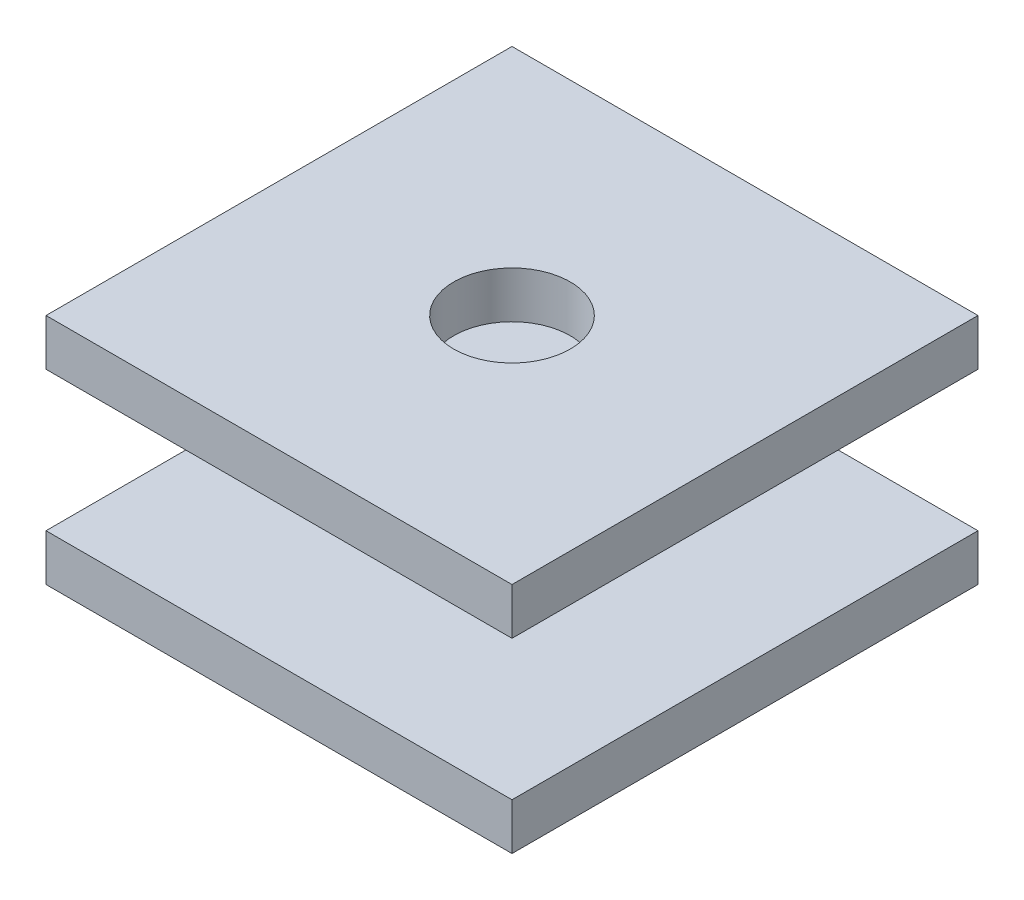
ISO-10303-21;
HEADER;
FILE_DESCRIPTION(('STEP AP214'),'2;1');
FILE_NAME('part.step','',(''),(''),'','','');
FILE_SCHEMA(('AUTOMOTIVE_DESIGN { 1 0 10303 214 1 1 1 1 }'));
ENDSEC;
DATA;
#1=APPLICATION_CONTEXT('core data for automotive mechanical design processes');
#2=APPLICATION_PROTOCOL_DEFINITION('international standard','automotive_design',2000,#1);
#3=PRODUCT_CONTEXT('',#1,'mechanical');
#4=PRODUCT('Part','Part','',(#3));
#5=PRODUCT_RELATED_PRODUCT_CATEGORY('part','',(#4));
#6=PRODUCT_DEFINITION_FORMATION('','',#4);
#7=PRODUCT_DEFINITION_CONTEXT('part definition',#1,'design');
#8=PRODUCT_DEFINITION('design','',#6,#7);
#9=PRODUCT_DEFINITION_SHAPE('','',#8);
#10=(LENGTH_UNIT() NAMED_UNIT(*) SI_UNIT(.MILLI.,.METRE.));
#11=(NAMED_UNIT(*) PLANE_ANGLE_UNIT() SI_UNIT($,.RADIAN.));
#12=(NAMED_UNIT(*) SI_UNIT($,.STERADIAN.) SOLID_ANGLE_UNIT());
#13=UNCERTAINTY_MEASURE_WITH_UNIT(LENGTH_MEASURE(1.E-05),#10,'distance_accuracy_value','');
#14=(GEOMETRIC_REPRESENTATION_CONTEXT(3) GLOBAL_UNCERTAINTY_ASSIGNED_CONTEXT((#13)) GLOBAL_UNIT_ASSIGNED_CONTEXT((#10,
#11,#12)) REPRESENTATION_CONTEXT('',''));
#15=CARTESIAN_POINT('',(0.,0.,0.));
#16=DIRECTION('',(0.,0.,1.));
#17=DIRECTION('',(1.,0.,0.));
#18=AXIS2_PLACEMENT_3D('',#15,#16,#17);
#19=CARTESIAN_POINT('',(0.,2.54,0.));
#20=DIRECTION('',(1.,0.,0.));
#21=DIRECTION('',(0.,0.,-1.));
#22=AXIS2_PLACEMENT_3D('',#19,#20,#21);
#23=PLANE('',#22);
#24=DIRECTION('',(0.,0.,1.));
#25=VECTOR('',#24,1.);
#26=CARTESIAN_POINT('',(0.,0.,0.));
#27=LINE('',#26,#25);
#28=CARTESIAN_POINT('',(0.,0.,-25.4));
#29=VERTEX_POINT('',#28);
#30=CARTESIAN_POINT('',(0.,0.,0.));
#31=VERTEX_POINT('',#30);
#32=EDGE_CURVE('E159',#29,#31,#27,.T.);
#33=ORIENTED_EDGE('',*,*,#32,.T.);
#34=DIRECTION('',(0.,-1.,0.));
#35=VECTOR('',#34,1.);
#36=CARTESIAN_POINT('',(0.,2.54,0.));
#37=LINE('',#36,#35);
#38=CARTESIAN_POINT('',(0.,2.54,0.));
#39=VERTEX_POINT('',#38);
#40=EDGE_CURVE('E42',#39,#31,#37,.T.);
#41=ORIENTED_EDGE('',*,*,#40,.F.);
#42=DIRECTION('',(0.,0.,1.));
#43=VECTOR('',#42,1.);
#44=CARTESIAN_POINT('',(0.,2.54,0.));
#45=LINE('',#44,#43);
#46=CARTESIAN_POINT('',(0.,2.54,-25.4));
#47=VERTEX_POINT('',#46);
#48=EDGE_CURVE('E163',#47,#39,#45,.T.);
#49=ORIENTED_EDGE('',*,*,#48,.F.);
#50=DIRECTION('',(0.,-1.,0.));
#51=VECTOR('',#50,1.);
#52=CARTESIAN_POINT('',(0.,2.54,-25.4));
#53=LINE('',#52,#51);
#54=EDGE_CURVE('E173',#47,#29,#53,.T.);
#55=ORIENTED_EDGE('',*,*,#54,.T.);
#56=EDGE_LOOP('',(#33,#41,#49,#55));
#57=FACE_BOUND('',#56,.T.);
#58=ADVANCED_FACE('F39',(#57),#23,.F.);
#59=CARTESIAN_POINT('',(0.,2.54,0.));
#60=DIRECTION('',(0.,0.,-1.));
#61=DIRECTION('',(-1.,0.,0.));
#62=AXIS2_PLACEMENT_3D('',#59,#60,#61);
#63=PLANE('',#62);
#64=DIRECTION('',(1.,0.,0.));
#65=VECTOR('',#64,1.);
#66=CARTESIAN_POINT('',(0.,0.,0.));
#67=LINE('',#66,#65);
#68=CARTESIAN_POINT('',(25.4,0.,0.));
#69=VERTEX_POINT('',#68);
#70=EDGE_CURVE('E177',#31,#69,#67,.T.);
#71=ORIENTED_EDGE('',*,*,#70,.T.);
#72=DIRECTION('',(0.,-1.,0.));
#73=VECTOR('',#72,1.);
#74=CARTESIAN_POINT('',(25.4,2.54,0.));
#75=LINE('',#74,#73);
#76=CARTESIAN_POINT('',(25.4,2.54,0.));
#77=VERTEX_POINT('',#76);
#78=EDGE_CURVE('E188',#77,#69,#75,.T.);
#79=ORIENTED_EDGE('',*,*,#78,.F.);
#80=DIRECTION('',(1.,0.,0.));
#81=VECTOR('',#80,1.);
#82=CARTESIAN_POINT('',(0.,2.54,0.));
#83=LINE('',#82,#81);
#84=EDGE_CURVE('E89',#39,#77,#83,.T.);
#85=ORIENTED_EDGE('',*,*,#84,.F.);
#86=ORIENTED_EDGE('',*,*,#40,.T.);
#87=EDGE_LOOP('',(#71,#79,#85,#86));
#88=FACE_BOUND('',#87,.T.);
#89=ADVANCED_FACE('F193',(#88),#63,.F.);
#90=CARTESIAN_POINT('',(25.4,2.54,0.));
#91=DIRECTION('',(-1.,0.,0.));
#92=DIRECTION('',(0.,0.,1.));
#93=AXIS2_PLACEMENT_3D('',#90,#91,#92);
#94=PLANE('',#93);
#95=DIRECTION('',(0.,0.,-1.));
#96=VECTOR('',#95,1.);
#97=CARTESIAN_POINT('',(25.4,0.,0.));
#98=LINE('',#97,#96);
#99=CARTESIAN_POINT('',(25.4,0.,-25.4));
#100=VERTEX_POINT('',#99);
#101=EDGE_CURVE('E75',#69,#100,#98,.T.);
#102=ORIENTED_EDGE('',*,*,#101,.T.);
#103=DIRECTION('',(0.,-1.,0.));
#104=VECTOR('',#103,1.);
#105=CARTESIAN_POINT('',(25.4,2.54,-25.4));
#106=LINE('',#105,#104);
#107=CARTESIAN_POINT('',(25.4,2.54,-25.4));
#108=VERTEX_POINT('',#107);
#109=EDGE_CURVE('E186',#108,#100,#106,.T.);
#110=ORIENTED_EDGE('',*,*,#109,.F.);
#111=DIRECTION('',(0.,0.,-1.));
#112=VECTOR('',#111,1.);
#113=CARTESIAN_POINT('',(25.4,2.54,0.));
#114=LINE('',#113,#112);
#115=EDGE_CURVE('E168',#77,#108,#114,.T.);
#116=ORIENTED_EDGE('',*,*,#115,.F.);
#117=ORIENTED_EDGE('',*,*,#78,.T.);
#118=EDGE_LOOP('',(#102,#110,#116,#117));
#119=FACE_BOUND('',#118,.T.);
#120=ADVANCED_FACE('F220',(#119),#94,.F.);
#121=CARTESIAN_POINT('',(0.,2.54,-25.4));
#122=DIRECTION('',(0.,0.,1.));
#123=DIRECTION('',(1.,0.,0.));
#124=AXIS2_PLACEMENT_3D('',#121,#122,#123);
#125=PLANE('',#124);
#126=DIRECTION('',(-1.,0.,0.));
#127=VECTOR('',#126,1.);
#128=CARTESIAN_POINT('',(0.,0.,-25.4));
#129=LINE('',#128,#127);
#130=EDGE_CURVE('E81',#100,#29,#129,.T.);
#131=ORIENTED_EDGE('',*,*,#130,.T.);
#132=ORIENTED_EDGE('',*,*,#54,.F.);
#133=DIRECTION('',(-1.,0.,0.));
#134=VECTOR('',#133,1.);
#135=CARTESIAN_POINT('',(0.,2.54,-25.4));
#136=LINE('',#135,#134);
#137=EDGE_CURVE('E57',#108,#47,#136,.T.);
#138=ORIENTED_EDGE('',*,*,#137,.F.);
#139=ORIENTED_EDGE('',*,*,#109,.T.);
#140=EDGE_LOOP('',(#131,#132,#138,#139));
#141=FACE_BOUND('',#140,.T.);
#142=ADVANCED_FACE('F211',(#141),#125,.F.);
#143=CARTESIAN_POINT('',(0.,2.54,0.));
#144=DIRECTION('',(0.,-1.,0.));
#145=DIRECTION('',(0.,0.,-1.));
#146=AXIS2_PLACEMENT_3D('',#143,#144,#145);
#147=PLANE('',#146);
#148=CARTESIAN_POINT('',(12.7,2.54,-12.7));
#149=DIRECTION('',(0.,1.,0.));
#150=DIRECTION('',(0.,0.,1.));
#151=AXIS2_PLACEMENT_3D('',#148,#149,#150);
#152=CIRCLE('',#151,3.81);
#153=CARTESIAN_POINT('',(12.7,2.54,-8.89));
#154=VERTEX_POINT('',#153);
#155=EDGE_CURVE('E11',#154,#154,#152,.T.);
#156=ORIENTED_EDGE('',*,*,#155,.F.);
#157=EDGE_LOOP('',(#156));
#158=FACE_BOUND('',#157,.T.);
#159=ORIENTED_EDGE('',*,*,#48,.T.);
#160=ORIENTED_EDGE('',*,*,#84,.T.);
#161=ORIENTED_EDGE('',*,*,#115,.T.);
#162=ORIENTED_EDGE('',*,*,#137,.T.);
#163=EDGE_LOOP('',(#159,#160,#161,#162));
#164=FACE_BOUND('',#163,.T.);
#165=ADVANCED_FACE('F201',(#158,#164),#147,.F.);
#166=CARTESIAN_POINT('',(0.,0.,0.));
#167=DIRECTION('',(0.,-1.,0.));
#168=DIRECTION('',(0.,0.,-1.));
#169=AXIS2_PLACEMENT_3D('',#166,#167,#168);
#170=PLANE('',#169);
#171=CARTESIAN_POINT('',(12.7,0.,-12.7));
#172=DIRECTION('',(0.,-1.,0.));
#173=DIRECTION('',(0.,0.,-1.));
#174=AXIS2_PLACEMENT_3D('',#171,#172,#173);
#175=CIRCLE('',#174,2.54);
#176=CARTESIAN_POINT('',(12.7,0.,-15.24));
#177=VERTEX_POINT('',#176);
#178=EDGE_CURVE('E149',#177,#177,#175,.T.);
#179=ORIENTED_EDGE('',*,*,#178,.F.);
#180=EDGE_LOOP('',(#179));
#181=FACE_BOUND('',#180,.T.);
#182=ORIENTED_EDGE('',*,*,#32,.F.);
#183=ORIENTED_EDGE('',*,*,#130,.F.);
#184=ORIENTED_EDGE('',*,*,#101,.F.);
#185=ORIENTED_EDGE('',*,*,#70,.F.);
#186=EDGE_LOOP('',(#182,#183,#184,#185));
#187=FACE_BOUND('',#186,.T.);
#188=ADVANCED_FACE('F198',(#181,#187),#170,.T.);
#189=CARTESIAN_POINT('',(12.7,-2.54,-12.7));
#190=DIRECTION('',(0.,1.,0.));
#191=DIRECTION('',(0.,0.,1.));
#192=AXIS2_PLACEMENT_3D('',#189,#190,#191);
#193=CYLINDRICAL_SURFACE('',#192,2.54);
#194=CARTESIAN_POINT('',(12.7,-2.54,-12.7));
#195=DIRECTION('',(0.,-1.,0.));
#196=DIRECTION('',(0.,0.,-1.));
#197=AXIS2_PLACEMENT_3D('',#194,#195,#196);
#198=CIRCLE('',#197,2.54);
#199=CARTESIAN_POINT('',(12.7,-2.54,-15.24));
#200=VERTEX_POINT('',#199);
#201=EDGE_CURVE('E155',#200,#200,#198,.T.);
#202=ORIENTED_EDGE('',*,*,#201,.F.);
#203=EDGE_LOOP('',(#202));
#204=FACE_BOUND('',#203,.T.);
#205=ORIENTED_EDGE('',*,*,#178,.T.);
#206=EDGE_LOOP('',(#205));
#207=FACE_BOUND('',#206,.T.);
#208=ADVANCED_FACE('F200',(#204,#207),#193,.T.);
#209=CARTESIAN_POINT('',(12.7,-2.54,-12.7));
#210=DIRECTION('',(0.,-1.,0.));
#211=DIRECTION('',(0.,0.,-1.));
#212=AXIS2_PLACEMENT_3D('',#209,#210,#211);
#213=PLANE('',#212);
#214=ORIENTED_EDGE('',*,*,#201,.T.);
#215=EDGE_LOOP('',(#214));
#216=FACE_BOUND('',#215,.T.);
#217=ADVANCED_FACE('F208',(#216),#213,.T.);
#218=CARTESIAN_POINT('',(12.7,10.16,-12.7));
#219=DIRECTION('',(0.,-1.,0.));
#220=DIRECTION('',(0.,0.,-1.));
#221=AXIS2_PLACEMENT_3D('',#218,#219,#220);
#222=CYLINDRICAL_SURFACE('',#221,3.81);
#223=CARTESIAN_POINT('',(12.7,10.16,-12.7));
#224=DIRECTION('',(0.,1.,0.));
#225=DIRECTION('',(0.,0.,1.));
#226=AXIS2_PLACEMENT_3D('',#223,#224,#225);
#227=CIRCLE('',#226,3.81);
#228=CARTESIAN_POINT('',(12.7,10.16,-8.89));
#229=VERTEX_POINT('',#228);
#230=EDGE_CURVE('E144',#229,#229,#227,.T.);
#231=ORIENTED_EDGE('',*,*,#230,.F.);
#232=EDGE_LOOP('',(#231));
#233=FACE_BOUND('',#232,.T.);
#234=ORIENTED_EDGE('',*,*,#155,.T.);
#235=EDGE_LOOP('',(#234));
#236=FACE_BOUND('',#235,.T.);
#237=ADVANCED_FACE('F245',(#233,#236),#222,.T.);
#238=CARTESIAN_POINT('',(25.4,12.7,0.));
#239=DIRECTION('',(-1.,0.,0.));
#240=DIRECTION('',(0.,0.,1.));
#241=AXIS2_PLACEMENT_3D('',#238,#239,#240);
#242=PLANE('',#241);
#243=DIRECTION('',(0.,0.,-1.));
#244=VECTOR('',#243,1.);
#245=CARTESIAN_POINT('',(25.4,10.16,0.));
#246=LINE('',#245,#244);
#247=CARTESIAN_POINT('',(25.4,10.16,0.));
#248=VERTEX_POINT('',#247);
#249=CARTESIAN_POINT('',(25.4,10.16,-25.4));
#250=VERTEX_POINT('',#249);
#251=EDGE_CURVE('E142',#248,#250,#246,.T.);
#252=ORIENTED_EDGE('',*,*,#251,.T.);
#253=DIRECTION('',(0.,-1.,0.));
#254=VECTOR('',#253,1.);
#255=CARTESIAN_POINT('',(25.4,12.7,-25.4));
#256=LINE('',#255,#254);
#257=CARTESIAN_POINT('',(25.4,12.7,-25.4));
#258=VERTEX_POINT('',#257);
#259=EDGE_CURVE('E120',#258,#250,#256,.T.);
#260=ORIENTED_EDGE('',*,*,#259,.F.);
#261=DIRECTION('',(0.,0.,-1.));
#262=VECTOR('',#261,1.);
#263=CARTESIAN_POINT('',(25.4,12.7,0.));
#264=LINE('',#263,#262);
#265=CARTESIAN_POINT('',(25.4,12.7,0.));
#266=VERTEX_POINT('',#265);
#267=EDGE_CURVE('E128',#266,#258,#264,.T.);
#268=ORIENTED_EDGE('',*,*,#267,.F.);
#269=DIRECTION('',(0.,-1.,0.));
#270=VECTOR('',#269,1.);
#271=CARTESIAN_POINT('',(25.4,12.7,0.));
#272=LINE('',#271,#270);
#273=EDGE_CURVE('E360',#266,#248,#272,.T.);
#274=ORIENTED_EDGE('',*,*,#273,.T.);
#275=EDGE_LOOP('',(#252,#260,#268,#274));
#276=FACE_BOUND('',#275,.T.);
#277=ADVANCED_FACE('F140',(#276),#242,.F.);
#278=CARTESIAN_POINT('',(0.,12.7,-25.4));
#279=DIRECTION('',(0.,0.,1.));
#280=DIRECTION('',(1.,0.,0.));
#281=AXIS2_PLACEMENT_3D('',#278,#279,#280);
#282=PLANE('',#281);
#283=DIRECTION('',(-1.,0.,0.));
#284=VECTOR('',#283,1.);
#285=CARTESIAN_POINT('',(0.,10.16,-25.4));
#286=LINE('',#285,#284);
#287=CARTESIAN_POINT('',(0.,10.16,-25.4));
#288=VERTEX_POINT('',#287);
#289=EDGE_CURVE('E352',#250,#288,#286,.T.);
#290=ORIENTED_EDGE('',*,*,#289,.T.);
#291=DIRECTION('',(0.,-1.,0.));
#292=VECTOR('',#291,1.);
#293=CARTESIAN_POINT('',(0.,12.7,-25.4));
#294=LINE('',#293,#292);
#295=CARTESIAN_POINT('',(0.,12.7,-25.4));
#296=VERTEX_POINT('',#295);
#297=EDGE_CURVE('E123',#296,#288,#294,.T.);
#298=ORIENTED_EDGE('',*,*,#297,.F.);
#299=DIRECTION('',(-1.,0.,0.));
#300=VECTOR('',#299,1.);
#301=CARTESIAN_POINT('',(0.,12.7,-25.4));
#302=LINE('',#301,#300);
#303=EDGE_CURVE('E116',#258,#296,#302,.T.);
#304=ORIENTED_EDGE('',*,*,#303,.F.);
#305=ORIENTED_EDGE('',*,*,#259,.T.);
#306=EDGE_LOOP('',(#290,#298,#304,#305));
#307=FACE_BOUND('',#306,.T.);
#308=ADVANCED_FACE('F118',(#307),#282,.F.);
#309=CARTESIAN_POINT('',(0.,12.7,0.));
#310=DIRECTION('',(1.,0.,0.));
#311=DIRECTION('',(0.,0.,-1.));
#312=AXIS2_PLACEMENT_3D('',#309,#310,#311);
#313=PLANE('',#312);
#314=DIRECTION('',(0.,0.,1.));
#315=VECTOR('',#314,1.);
#316=CARTESIAN_POINT('',(0.,10.16,0.));
#317=LINE('',#316,#315);
#318=CARTESIAN_POINT('',(0.,10.16,0.));
#319=VERTEX_POINT('',#318);
#320=EDGE_CURVE('E364',#288,#319,#317,.T.);
#321=ORIENTED_EDGE('',*,*,#320,.T.);
#322=DIRECTION('',(0.,-1.,0.));
#323=VECTOR('',#322,1.);
#324=CARTESIAN_POINT('',(0.,12.7,0.));
#325=LINE('',#324,#323);
#326=CARTESIAN_POINT('',(0.,12.7,0.));
#327=VERTEX_POINT('',#326);
#328=EDGE_CURVE('E151',#327,#319,#325,.T.);
#329=ORIENTED_EDGE('',*,*,#328,.F.);
#330=DIRECTION('',(0.,0.,1.));
#331=VECTOR('',#330,1.);
#332=CARTESIAN_POINT('',(0.,12.7,0.));
#333=LINE('',#332,#331);
#334=EDGE_CURVE('E127',#296,#327,#333,.T.);
#335=ORIENTED_EDGE('',*,*,#334,.F.);
#336=ORIENTED_EDGE('',*,*,#297,.T.);
#337=EDGE_LOOP('',(#321,#329,#335,#336));
#338=FACE_BOUND('',#337,.T.);
#339=ADVANCED_FACE('F267',(#338),#313,.F.);
#340=CARTESIAN_POINT('',(0.,12.7,0.));
#341=DIRECTION('',(0.,0.,-1.));
#342=DIRECTION('',(-1.,0.,0.));
#343=AXIS2_PLACEMENT_3D('',#340,#341,#342);
#344=PLANE('',#343);
#345=DIRECTION('',(1.,0.,0.));
#346=VECTOR('',#345,1.);
#347=CARTESIAN_POINT('',(0.,10.16,0.));
#348=LINE('',#347,#346);
#349=EDGE_CURVE('E138',#319,#248,#348,.T.);
#350=ORIENTED_EDGE('',*,*,#349,.T.);
#351=ORIENTED_EDGE('',*,*,#273,.F.);
#352=DIRECTION('',(1.,0.,0.));
#353=VECTOR('',#352,1.);
#354=CARTESIAN_POINT('',(0.,12.7,0.));
#355=LINE('',#354,#353);
#356=EDGE_CURVE('E133',#327,#266,#355,.T.);
#357=ORIENTED_EDGE('',*,*,#356,.F.);
#358=ORIENTED_EDGE('',*,*,#328,.T.);
#359=EDGE_LOOP('',(#350,#351,#357,#358));
#360=FACE_BOUND('',#359,.T.);
#361=ADVANCED_FACE('F276',(#360),#344,.F.);
#362=CARTESIAN_POINT('',(0.,12.7,0.));
#363=DIRECTION('',(0.,-1.,0.));
#364=DIRECTION('',(0.,0.,-1.));
#365=AXIS2_PLACEMENT_3D('',#362,#363,#364);
#366=PLANE('',#365);
#367=CARTESIAN_POINT('',(12.7,12.7,-12.7));
#368=DIRECTION('',(0.,1.,0.));
#369=DIRECTION('',(0.,0.,1.));
#370=AXIS2_PLACEMENT_3D('',#367,#368,#369);
#371=CIRCLE('',#370,3.175);
#372=CARTESIAN_POINT('',(12.7,12.7,-9.525));
#373=VERTEX_POINT('',#372);
#374=EDGE_CURVE('E348',#373,#373,#371,.T.);
#375=ORIENTED_EDGE('',*,*,#374,.F.);
#376=EDGE_LOOP('',(#375));
#377=FACE_BOUND('',#376,.T.);
#378=ORIENTED_EDGE('',*,*,#267,.T.);
#379=ORIENTED_EDGE('',*,*,#303,.T.);
#380=ORIENTED_EDGE('',*,*,#334,.T.);
#381=ORIENTED_EDGE('',*,*,#356,.T.);
#382=EDGE_LOOP('',(#378,#379,#380,#381));
#383=FACE_BOUND('',#382,.T.);
#384=ADVANCED_FACE('F131',(#377,#383),#366,.F.);
#385=CARTESIAN_POINT('',(0.,10.16,0.));
#386=DIRECTION('',(0.,-1.,0.));
#387=DIRECTION('',(0.,0.,-1.));
#388=AXIS2_PLACEMENT_3D('',#385,#386,#387);
#389=PLANE('',#388);
#390=ORIENTED_EDGE('',*,*,#230,.T.);
#391=EDGE_LOOP('',(#390));
#392=FACE_BOUND('',#391,.T.);
#393=ORIENTED_EDGE('',*,*,#251,.F.);
#394=ORIENTED_EDGE('',*,*,#349,.F.);
#395=ORIENTED_EDGE('',*,*,#320,.F.);
#396=ORIENTED_EDGE('',*,*,#289,.F.);
#397=EDGE_LOOP('',(#393,#394,#395,#396));
#398=FACE_BOUND('',#397,.T.);
#399=ADVANCED_FACE('F293',(#392,#398),#389,.T.);
#400=CARTESIAN_POINT('',(12.7,10.16,-12.7));
#401=DIRECTION('',(0.,1.,0.));
#402=DIRECTION('',(0.,0.,1.));
#403=AXIS2_PLACEMENT_3D('',#400,#401,#402);
#404=CYLINDRICAL_SURFACE('',#403,3.175);
#405=CARTESIAN_POINT('',(12.7,10.16,-12.7));
#406=DIRECTION('',(0.,1.,0.));
#407=DIRECTION('',(0.,0.,1.));
#408=AXIS2_PLACEMENT_3D('',#405,#406,#407);
#409=CIRCLE('',#408,3.175);
#410=CARTESIAN_POINT('',(12.7,10.16,-9.525));
#411=VERTEX_POINT('',#410);
#412=EDGE_CURVE('E346',#411,#411,#409,.T.);
#413=ORIENTED_EDGE('',*,*,#412,.F.);
#414=EDGE_LOOP('',(#413));
#415=FACE_BOUND('',#414,.T.);
#416=ORIENTED_EDGE('',*,*,#374,.T.);
#417=EDGE_LOOP('',(#416));
#418=FACE_BOUND('',#417,.T.);
#419=ADVANCED_FACE('F298',(#415,#418),#404,.F.);
#420=CARTESIAN_POINT('',(12.7,10.16,-12.7));
#421=DIRECTION('',(0.,1.,0.));
#422=DIRECTION('',(0.,0.,1.));
#423=AXIS2_PLACEMENT_3D('',#420,#421,#422);
#424=PLANE('',#423);
#425=ORIENTED_EDGE('',*,*,#412,.T.);
#426=EDGE_LOOP('',(#425));
#427=FACE_BOUND('',#426,.T.);
#428=ADVANCED_FACE('F315',(#427),#424,.T.);
#429=CLOSED_SHELL('',(#58,#89,#120,#142,#165,#188,#208,#217,#237,#277,#308,#339,#361,#384,#399,
#419,#428));
#430=MANIFOLD_SOLID_BREP('B2',#429);
#431=ADVANCED_BREP_SHAPE_REPRESENTATION('',(#18,#430),#14);
#432=SHAPE_DEFINITION_REPRESENTATION(#9,#431);
ENDSEC;
END-ISO-10303-21;
